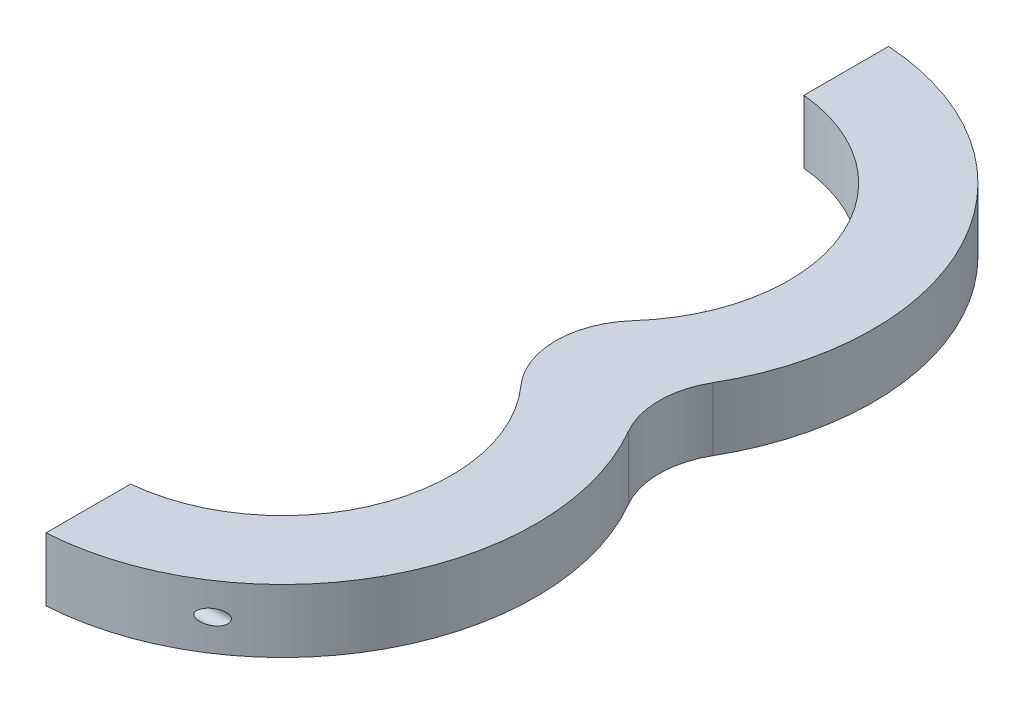
ISO-10303-21;
HEADER;
FILE_DESCRIPTION(('STEP AP214'),'2;1');
FILE_NAME('part.step','',(''),(''),'','','');
FILE_SCHEMA(('AUTOMOTIVE_DESIGN { 1 0 10303 214 1 1 1 1 }'));
ENDSEC;
DATA;
#1=APPLICATION_CONTEXT('core data for automotive mechanical design processes');
#2=APPLICATION_PROTOCOL_DEFINITION('international standard','automotive_design',2000,#1);
#3=PRODUCT_CONTEXT('',#1,'mechanical');
#4=PRODUCT('Part','Part','',(#3));
#5=PRODUCT_RELATED_PRODUCT_CATEGORY('part','',(#4));
#6=PRODUCT_DEFINITION_FORMATION('','',#4);
#7=PRODUCT_DEFINITION_CONTEXT('part definition',#1,'design');
#8=PRODUCT_DEFINITION('design','',#6,#7);
#9=PRODUCT_DEFINITION_SHAPE('','',#8);
#10=(LENGTH_UNIT() NAMED_UNIT(*) SI_UNIT(.MILLI.,.METRE.));
#11=(NAMED_UNIT(*) PLANE_ANGLE_UNIT() SI_UNIT($,.RADIAN.));
#12=(NAMED_UNIT(*) SI_UNIT($,.STERADIAN.) SOLID_ANGLE_UNIT());
#13=UNCERTAINTY_MEASURE_WITH_UNIT(LENGTH_MEASURE(1.E-05),#10,'distance_accuracy_value','');
#14=(GEOMETRIC_REPRESENTATION_CONTEXT(3) GLOBAL_UNCERTAINTY_ASSIGNED_CONTEXT((#13)) GLOBAL_UNIT_ASSIGNED_CONTEXT((#10,
#11,#12)) REPRESENTATION_CONTEXT('',''));
#15=CARTESIAN_POINT('',(0.,0.,0.));
#16=DIRECTION('',(0.,0.,1.));
#17=DIRECTION('',(1.,0.,0.));
#18=AXIS2_PLACEMENT_3D('',#15,#16,#17);
#19=CARTESIAN_POINT('',(219.2,-4.7625,25.4));
#20=DIRECTION('',(0.,-1.,0.));
#21=DIRECTION('',(0.,0.,-1.));
#22=AXIS2_PLACEMENT_3D('',#19,#20,#21);
#23=PLANE('',#22);
#24=DIRECTION('',(0.,0.,1.));
#25=VECTOR('',#24,1.);
#26=CARTESIAN_POINT('',(272.38125,-4.7625,-50.6881325612924));
#27=LINE('',#26,#25);
#28=CARTESIAN_POINT('',(272.38125,-4.7625,-63.4255131252361));
#29=VERTEX_POINT('',#28);
#30=CARTESIAN_POINT('',(272.38125,-4.7625,-50.6881325612924));
#31=VERTEX_POINT('',#30);
#32=EDGE_CURVE('E65',#29,#31,#27,.T.);
#33=ORIENTED_EDGE('',*,*,#32,.F.);
#34=CARTESIAN_POINT('',(270.,-4.7625,-25.4));
#35=DIRECTION('',(0.,1.,0.));
#36=DIRECTION('',(0.,0.,1.));
#37=AXIS2_PLACEMENT_3D('',#34,#35,#36);
#38=CIRCLE('',#37,38.1);
#39=CARTESIAN_POINT('',(302.995567884187,-4.7625,-6.34999999999999));
#40=VERTEX_POINT('',#39);
#41=EDGE_CURVE('E122',#40,#29,#38,.T.);
#42=ORIENTED_EDGE('',*,*,#41,.F.);
#43=CARTESIAN_POINT('',(313.994090512249,-4.7625,0.));
#44=DIRECTION('',(0.,-1.,0.));
#45=DIRECTION('',(0.,0.,1.));
#46=AXIS2_PLACEMENT_3D('',#43,#44,#45);
#47=CIRCLE('',#46,12.7);
#48=CARTESIAN_POINT('',(302.995567884187,-4.7625,6.34999999999999));
#49=VERTEX_POINT('',#48);
#50=EDGE_CURVE('E136',#49,#40,#47,.T.);
#51=ORIENTED_EDGE('',*,*,#50,.F.);
#52=CARTESIAN_POINT('',(270.,-4.7625,25.4));
#53=DIRECTION('',(0.,1.,0.));
#54=DIRECTION('',(0.,0.,1.));
#55=AXIS2_PLACEMENT_3D('',#52,#53,#54);
#56=CIRCLE('',#55,38.1);
#57=CARTESIAN_POINT('',(272.38125,-4.7625,63.4255131252361));
#58=VERTEX_POINT('',#57);
#59=EDGE_CURVE('E134',#58,#49,#56,.T.);
#60=ORIENTED_EDGE('',*,*,#59,.F.);
#61=DIRECTION('',(0.,0.,1.));
#62=VECTOR('',#61,1.);
#63=CARTESIAN_POINT('',(272.38125,-4.7625,50.6881325612925));
#64=LINE('',#63,#62);
#65=CARTESIAN_POINT('',(272.38125,-4.7625,50.6881325612925));
#66=VERTEX_POINT('',#65);
#67=EDGE_CURVE('E166',#66,#58,#64,.T.);
#68=ORIENTED_EDGE('',*,*,#67,.F.);
#69=CARTESIAN_POINT('',(270.,-4.7625,25.4));
#70=DIRECTION('',(0.,1.,0.));
#71=DIRECTION('',(0.,0.,1.));
#72=AXIS2_PLACEMENT_3D('',#69,#70,#71);
#73=CIRCLE('',#72,25.4);
#74=CARTESIAN_POINT('',(288.932042209498,-4.7625,8.46666666666666));
#75=VERTEX_POINT('',#74);
#76=EDGE_CURVE('E154',#66,#75,#73,.T.);
#77=ORIENTED_EDGE('',*,*,#76,.T.);
#78=CARTESIAN_POINT('',(298.398063314247,-4.7625,0.));
#79=DIRECTION('',(0.,-1.,0.));
#80=DIRECTION('',(0.,0.,1.));
#81=AXIS2_PLACEMENT_3D('',#78,#79,#80);
#82=CIRCLE('',#81,12.7);
#83=CARTESIAN_POINT('',(288.932042209498,-4.7625,-8.46666666666668));
#84=VERTEX_POINT('',#83);
#85=EDGE_CURVE('E151',#75,#84,#82,.T.);
#86=ORIENTED_EDGE('',*,*,#85,.T.);
#87=CARTESIAN_POINT('',(270.,-4.7625,-25.4));
#88=DIRECTION('',(0.,1.,0.));
#89=DIRECTION('',(0.,0.,1.));
#90=AXIS2_PLACEMENT_3D('',#87,#88,#89);
#91=CIRCLE('',#90,25.4);
#92=EDGE_CURVE('E147',#84,#31,#91,.T.);
#93=ORIENTED_EDGE('',*,*,#92,.T.);
#94=EDGE_LOOP('',(#33,#42,#51,#60,#68,#77,#86,#93));
#95=FACE_BOUND('',#94,.T.);
#96=ADVANCED_FACE('F36',(#95),#23,.T.);
#97=CARTESIAN_POINT('',(313.994090512249,4.7625,0.));
#98=DIRECTION('',(0.,-1.,0.));
#99=DIRECTION('',(0.,0.,-1.));
#100=AXIS2_PLACEMENT_3D('',#97,#98,#99);
#101=CYLINDRICAL_SURFACE('',#100,12.7);
#102=ORIENTED_EDGE('',*,*,#50,.T.);
#103=DIRECTION('',(0.,-1.,0.));
#104=VECTOR('',#103,1.);
#105=CARTESIAN_POINT('',(302.995567884187,4.7625,-6.34999999999999));
#106=LINE('',#105,#104);
#107=CARTESIAN_POINT('',(302.995567884187,4.7625,-6.34999999999999));
#108=VERTEX_POINT('',#107);
#109=EDGE_CURVE('E50',#108,#40,#106,.T.);
#110=ORIENTED_EDGE('',*,*,#109,.F.);
#111=CARTESIAN_POINT('',(313.994090512249,4.7625,0.));
#112=DIRECTION('',(0.,-1.,0.));
#113=DIRECTION('',(0.,0.,1.));
#114=AXIS2_PLACEMENT_3D('',#111,#112,#113);
#115=CIRCLE('',#114,12.7);
#116=CARTESIAN_POINT('',(302.995567884187,4.7625,6.34999999999999));
#117=VERTEX_POINT('',#116);
#118=EDGE_CURVE('E126',#117,#108,#115,.T.);
#119=ORIENTED_EDGE('',*,*,#118,.F.);
#120=DIRECTION('',(0.,-1.,0.));
#121=VECTOR('',#120,1.);
#122=CARTESIAN_POINT('',(302.995567884187,4.7625,6.34999999999999));
#123=LINE('',#122,#121);
#124=EDGE_CURVE('E11',#117,#49,#123,.T.);
#125=ORIENTED_EDGE('',*,*,#124,.T.);
#126=EDGE_LOOP('',(#102,#110,#119,#125));
#127=FACE_BOUND('',#126,.T.);
#128=ADVANCED_FACE('F205',(#127),#101,.F.);
#129=CARTESIAN_POINT('',(298.398063314247,4.7625,0.));
#130=DIRECTION('',(0.,-1.,0.));
#131=DIRECTION('',(0.,0.,-1.));
#132=AXIS2_PLACEMENT_3D('',#129,#130,#131);
#133=CYLINDRICAL_SURFACE('',#132,12.7);
#134=ORIENTED_EDGE('',*,*,#85,.F.);
#135=DIRECTION('',(0.,-1.,0.));
#136=VECTOR('',#135,1.);
#137=CARTESIAN_POINT('',(288.932042209498,4.7625,8.46666666666666));
#138=LINE('',#137,#136);
#139=CARTESIAN_POINT('',(288.932042209498,4.7625,8.46666666666666));
#140=VERTEX_POINT('',#139);
#141=EDGE_CURVE('E137',#140,#75,#138,.T.);
#142=ORIENTED_EDGE('',*,*,#141,.F.);
#143=CARTESIAN_POINT('',(298.398063314247,4.7625,0.));
#144=DIRECTION('',(0.,-1.,0.));
#145=DIRECTION('',(0.,0.,1.));
#146=AXIS2_PLACEMENT_3D('',#143,#144,#145);
#147=CIRCLE('',#146,12.7);
#148=CARTESIAN_POINT('',(288.932042209498,4.7625,-8.46666666666669));
#149=VERTEX_POINT('',#148);
#150=EDGE_CURVE('E157',#140,#149,#147,.T.);
#151=ORIENTED_EDGE('',*,*,#150,.T.);
#152=DIRECTION('',(0.,-1.,0.));
#153=VECTOR('',#152,1.);
#154=CARTESIAN_POINT('',(288.932042209498,4.7625,-8.46666666666668));
#155=LINE('',#154,#153);
#156=EDGE_CURVE('E144',#149,#84,#155,.T.);
#157=ORIENTED_EDGE('',*,*,#156,.T.);
#158=EDGE_LOOP('',(#134,#142,#151,#157));
#159=FACE_BOUND('',#158,.T.);
#160=ADVANCED_FACE('F202',(#159),#133,.T.);
#161=CARTESIAN_POINT('',(270.,4.7625,-25.4));
#162=DIRECTION('',(0.,-1.,0.));
#163=DIRECTION('',(0.,0.,-1.));
#164=AXIS2_PLACEMENT_3D('',#161,#162,#163);
#165=CYLINDRICAL_SURFACE('',#164,38.1);
#166=CARTESIAN_POINT('',(289.406560119215,0.,-58.1871228432642));
#167=CARTESIAN_POINT('',(289.406562233935,0.0346801125895639,-58.1871216207946));
#168=CARTESIAN_POINT('',(289.409284095073,0.0693698752678581,-58.1855109939541));
#169=CARTESIAN_POINT('',(289.419883175325,0.137668433217253,-58.1792338705122));
#170=CARTESIAN_POINT('',(289.427765688506,0.171276081212509,-58.1745642358164));
#171=CARTESIAN_POINT('',(289.450302147413,0.244149867071134,-58.1611958309623));
#172=CARTESIAN_POINT('',(289.466098696342,0.28293285932613,-58.1518160923462));
#173=CARTESIAN_POINT('',(289.502830730684,0.357018850528717,-58.1299564807417));
#174=CARTESIAN_POINT('',(289.523775999186,0.39231504309651,-58.1174707054219));
#175=CARTESIAN_POINT('',(289.581934432732,0.477790477666184,-58.0827098089543));
#176=CARTESIAN_POINT('',(289.621767567246,0.525508661634553,-58.0588225025396));
#177=CARTESIAN_POINT('',(289.706931435582,0.613503294476221,-58.0075044573772));
#178=CARTESIAN_POINT('',(289.752275625829,0.653760896745626,-57.9800650343));
#179=CARTESIAN_POINT('',(289.841757949813,0.724232832760032,-57.9256377411945));
#180=CARTESIAN_POINT('',(289.885568603557,0.755047536320301,-57.8988756785087));
#181=CARTESIAN_POINT('',(289.975165918582,0.812212736925812,-57.8438825271822));
#182=CARTESIAN_POINT('',(290.020954093864,0.83855973463429,-57.8156503094552));
#183=CARTESIAN_POINT('',(290.113979254642,0.887322189742761,-57.7580104263982));
#184=CARTESIAN_POINT('',(290.161218630081,0.909730702648264,-57.7286007948817));
#185=CARTESIAN_POINT('',(290.25668801677,0.950944877747121,-57.6688668202606));
#186=CARTESIAN_POINT('',(290.304918335998,0.969749400509859,-57.6385421913678));
#187=CARTESIAN_POINT('',(290.432583828691,1.01479895716542,-57.5578646075085));
#188=CARTESIAN_POINT('',(290.512600709846,1.0383039134802,-57.5068895230887));
#189=CARTESIAN_POINT('',(290.673646396888,1.07726300966779,-57.4034298434705));
#190=CARTESIAN_POINT('',(290.754675819533,1.09271197050571,-57.3509443000471));
#191=CARTESIAN_POINT('',(290.917161041848,1.11588160140344,-57.2448080084178));
#192=CARTESIAN_POINT('',(290.998617119342,1.12359637420809,-57.1911564028955));
#193=CARTESIAN_POINT('',(291.161337946686,1.13129259033628,-57.0830760763894));
#194=CARTESIAN_POINT('',(291.242602763092,1.13127731614336,-57.0286476950737));
#195=CARTESIAN_POINT('',(291.388055455731,1.12405871127778,-56.9304163246908));
#196=CARTESIAN_POINT('',(291.452370935984,1.11831072964363,-56.8866922353655));
#197=CARTESIAN_POINT('',(291.580248746316,1.10144761486723,-56.7991856966475));
#198=CARTESIAN_POINT('',(291.643811230021,1.09033359652731,-56.7554032612594));
#199=CARTESIAN_POINT('',(291.769649624393,1.06236396339444,-56.6681659175263));
#200=CARTESIAN_POINT('',(291.831928488309,1.04552358206269,-56.624710449686));
#201=CARTESIAN_POINT('',(291.95483067079,1.00553183203822,-56.5384174573502));
#202=CARTESIAN_POINT('',(292.015455042425,0.982384585789599,-56.4955795483824));
#203=CARTESIAN_POINT('',(292.138884830195,0.926979653277689,-56.4078366226465));
#204=CARTESIAN_POINT('',(292.201507844251,0.894164871834992,-56.363020671042));
#205=CARTESIAN_POINT('',(292.322698553718,0.819046005067672,-56.2757620196224));
#206=CARTESIAN_POINT('',(292.381268255155,0.776746658344159,-56.2333181478712));
#207=CARTESIAN_POINT('',(292.479377728113,0.69202666469989,-56.1618332728355));
#208=CARTESIAN_POINT('',(292.520209367346,0.6518382902294,-56.1319445763034));
#209=CARTESIAN_POINT('',(292.596339594416,0.564162389637554,-56.0760110144988));
#210=CARTESIAN_POINT('',(292.631649150578,0.516689713649981,-56.0499585356567));
#211=CARTESIAN_POINT('',(292.684995516328,0.429326993468788,-56.010484166137));
#212=CARTESIAN_POINT('',(292.705053301311,0.391340935065918,-55.9956047547817));
#213=CARTESIAN_POINT('',(292.740061532444,0.31185755350866,-55.96959399213));
#214=CARTESIAN_POINT('',(292.755015811396,0.270362894714637,-55.9584598281929));
#215=CARTESIAN_POINT('',(292.778768700667,0.184195687573772,-55.940758400379));
#216=CARTESIAN_POINT('',(292.787503851091,0.139495361649586,-55.934238221502));
#217=CARTESIAN_POINT('',(292.797648382188,0.0488222805704054,-55.9266649498136));
#218=CARTESIAN_POINT('',(292.799064888994,0.00285080700369756,-55.9256065389034));
#219=CARTESIAN_POINT('',(292.7947719878,-0.0818883479753645,-55.9288121444724));
#220=CARTESIAN_POINT('',(292.790058301424,-0.120741041965621,-55.9323324534614));
#221=CARTESIAN_POINT('',(292.775563865996,-0.196938195470066,-55.9431460669602));
#222=CARTESIAN_POINT('',(292.76578093001,-0.234281996528674,-55.950440999885));
#223=CARTESIAN_POINT('',(292.738643262385,-0.316263147761094,-55.9706469545663));
#224=CARTESIAN_POINT('',(292.719970890241,-0.360220603107252,-55.9845325758885));
#225=CARTESIAN_POINT('',(292.677122491262,-0.443770910076259,-56.0163163767324));
#226=CARTESIAN_POINT('',(292.652936787548,-0.483355903699907,-56.0342216105398));
#227=CARTESIAN_POINT('',(292.588425674969,-0.575104789021504,-56.08183935514));
#228=CARTESIAN_POINT('',(292.545774031392,-0.624756084429294,-56.1132094852051));
#229=CARTESIAN_POINT('',(292.454692328507,-0.715328808539313,-56.179863518933));
#230=CARTESIAN_POINT('',(292.406249534233,-0.756230424680561,-56.2151560356407));
#231=CARTESIAN_POINT('',(292.31476247538,-0.823512784541487,-56.2814501260151));
#232=CARTESIAN_POINT('',(292.272356745203,-0.851180937563113,-56.3120521177981));
#233=CARTESIAN_POINT('',(292.185624476951,-0.901906171715305,-56.3743591989242));
#234=CARTESIAN_POINT('',(292.141296765804,-0.92496038714368,-56.4060649595535));
#235=CARTESIAN_POINT('',(292.006105546879,-0.987921669335295,-56.502307062415));
#236=CARTESIAN_POINT('',(291.913082185523,-1.02159388106021,-56.567933207491));
#237=CARTESIAN_POINT('',(291.744222522421,-1.06916230874567,-56.6858923345634));
#238=CARTESIAN_POINT('',(291.668975194095,-1.08575016733129,-56.7380601223131));
#239=CARTESIAN_POINT('',(291.517164249508,-1.11109313957978,-56.8424890943284));
#240=CARTESIAN_POINT('',(291.44059989255,-1.11984368829351,-56.8947503152831));
#241=CARTESIAN_POINT('',(291.286498530095,-1.13004659119717,-56.9991088197158));
#242=CARTESIAN_POINT('',(291.208959032781,-1.13147286092573,-57.051204857822));
#243=CARTESIAN_POINT('',(291.053657074615,-1.12724291461275,-57.1547197845982));
#244=CARTESIAN_POINT('',(290.975894684556,-1.12158874210598,-57.2061388643223));
#245=CARTESIAN_POINT('',(290.817869152717,-1.10292761958626,-57.309803526319));
#246=CARTESIAN_POINT('',(290.737613212397,-1.08967151073022,-57.3620155490388));
#247=CARTESIAN_POINT('',(290.577823428524,-1.05537809196454,-57.4651247523037));
#248=CARTESIAN_POINT('',(290.498290111918,-1.03433550806967,-57.516021016595));
#249=CARTESIAN_POINT('',(290.3412582736,-0.984035098688015,-57.6157074539435));
#250=CARTESIAN_POINT('',(290.263749943172,-0.954831078696793,-57.6645090839277));
#251=CARTESIAN_POINT('',(290.111424710099,-0.887124227906148,-57.7596757994706));
#252=CARTESIAN_POINT('',(290.03660337167,-0.848637616416994,-57.8060449650386));
#253=CARTESIAN_POINT('',(289.921400282478,-0.778699051811462,-57.8769200626549));
#254=CARTESIAN_POINT('',(289.87951975397,-0.750872490458157,-57.9025688499635));
#255=CARTESIAN_POINT('',(289.797957233063,-0.690794778404592,-57.952314286829));
#256=CARTESIAN_POINT('',(289.758277007472,-0.658540142244464,-57.9764096914989));
#257=CARTESIAN_POINT('',(289.681878318495,-0.588704875120458,-58.0226251784179));
#258=CARTESIAN_POINT('',(289.645185088736,-0.551085044472116,-58.0447285725392));
#259=CARTESIAN_POINT('',(289.576799076671,-0.469972112411677,-58.0857846518375));
#260=CARTESIAN_POINT('',(289.545097273371,-0.426489876493713,-58.1047430244097));
#261=CARTESIAN_POINT('',(289.498682359433,-0.348899682197522,-58.1324282438669));
#262=CARTESIAN_POINT('',(289.481838045911,-0.31654167496011,-58.1424537267425));
#263=CARTESIAN_POINT('',(289.452568701086,-0.249216596669655,-58.1598513568702));
#264=CARTESIAN_POINT('',(289.44013626072,-0.214254020239572,-58.1672279527718));
#265=CARTESIAN_POINT('',(289.422682617623,-0.149473715357125,-58.177575909201));
#266=CARTESIAN_POINT('',(289.41667921632,-0.120015645840364,-58.1811316116476));
#267=CARTESIAN_POINT('',(289.408617602413,-0.0603740174385645,-58.185905281459));
#268=CARTESIAN_POINT('',(289.406558278252,-0.0301906653885602,-58.1871239074815));
#269=CARTESIAN_POINT('',(289.406560119215,0.,-58.1871228432642));
#270=B_SPLINE_CURVE_WITH_KNOTS('',3,(#166,#167,#168,#169,#170,#171,#172,#173,#174,#175,#176,
#177,#178,#179,#180,#181,#182,#183,#184,#185,#186,#187,#188,#189,#190,#191,#192,#193,#194,#195,
#196,#197,#198,#199,#200,#201,#202,#203,#204,#205,#206,#207,#208,#209,#210,#211,#212,#213,#214,
#215,#216,#217,#218,#219,#220,#221,#222,#223,#224,#225,#226,#227,#228,#229,#230,#231,#232,#233,
#234,#235,#236,#237,#238,#239,#240,#241,#242,#243,#244,#245,#246,#247,#248,#249,#250,#251,#252,
#253,#254,#255,#256,#257,#258,#259,#260,#261,#262,#263,#264,#265,#266,#267,#268,#269),
.UNSPECIFIED.,.T.,.F.,(4,2,2,2,2,2,2,2,2,2,2,2,2,2,2,2,2,2,2,2,2,2,2,2,2,2,2,2,2,2,2,2,2,2,2,2,
2,2,2,2,2,2,2,2,2,2,2,2,2,2,2,4),(0.,0.103920496165342,0.207947766843529,0.335972824378085,
0.464243048721362,0.6628989252404,0.862049993625712,1.04142215738254,1.22093417211763,
1.40075960170757,1.58064179111219,1.87345124355099,2.16644870585037,2.45966940678813,
2.75276559472907,2.98654478985379,3.22027543787756,3.45338911007562,3.68635077296566,
3.93695095565995,4.187426213411,4.38071925837762,4.57362335752059,4.70953063169235,
4.84533561188242,4.98250722011539,5.11954523974022,5.23687094599213,5.35424731012057,
5.50263632081444,5.65128781382482,5.86783439079446,6.08486623840808,6.26210805900783,
6.43945962462442,6.79436559999853,7.07321350585504,7.3522237250894,7.63222691699457,
7.91214931388929,8.2018182237878,8.4916836943003,8.77968152165739,9.06717973519756,
9.23633592991024,9.40562604380066,9.57622326423973,9.7465085351751,9.85965750936607,
9.97261555784624,10.0631087336916,10.1535764021179),.UNSPECIFIED.);
#271=CARTESIAN_POINT('',(289.406560119215,0.,-58.1871228432642));
#272=VERTEX_POINT('',#271);
#273=EDGE_CURVE('E174',#272,#272,#270,.T.);
#274=ORIENTED_EDGE('',*,*,#273,.F.);
#275=EDGE_LOOP('',(#274));
#276=FACE_BOUND('',#275,.T.);
#277=ORIENTED_EDGE('',*,*,#41,.T.);
#278=DIRECTION('',(0.,-1.,0.));
#279=VECTOR('',#278,1.);
#280=CARTESIAN_POINT('',(272.38125,4.7625,-63.4255131252361));
#281=LINE('',#280,#279);
#282=CARTESIAN_POINT('',(272.38125,4.7625,-63.4255131252361));
#283=VERTEX_POINT('',#282);
#284=EDGE_CURVE('E108',#283,#29,#281,.T.);
#285=ORIENTED_EDGE('',*,*,#284,.F.);
#286=CARTESIAN_POINT('',(270.,4.7625,-25.4));
#287=DIRECTION('',(0.,1.,0.));
#288=DIRECTION('',(0.,0.,1.));
#289=AXIS2_PLACEMENT_3D('',#286,#287,#288);
#290=CIRCLE('',#289,38.1);
#291=EDGE_CURVE('E120',#108,#283,#290,.T.);
#292=ORIENTED_EDGE('',*,*,#291,.F.);
#293=ORIENTED_EDGE('',*,*,#109,.T.);
#294=EDGE_LOOP('',(#277,#285,#292,#293));
#295=FACE_BOUND('',#294,.T.);
#296=ADVANCED_FACE('F118',(#276,#295),#165,.T.);
#297=CARTESIAN_POINT('',(270.,4.7625,25.4));
#298=DIRECTION('',(0.,-1.,0.));
#299=DIRECTION('',(0.,0.,-1.));
#300=AXIS2_PLACEMENT_3D('',#297,#298,#299);
#301=CYLINDRICAL_SURFACE('',#300,25.4);
#302=DIRECTION('',(0.,-1.,0.));
#303=VECTOR('',#302,1.);
#304=CARTESIAN_POINT('',(272.38125,4.7625,50.6881325612925));
#305=LINE('',#304,#303);
#306=CARTESIAN_POINT('',(272.38125,4.7625,50.6881325612925));
#307=VERTEX_POINT('',#306);
#308=EDGE_CURVE('E161',#307,#66,#305,.T.);
#309=ORIENTED_EDGE('',*,*,#308,.F.);
#310=CARTESIAN_POINT('',(270.,4.7625,25.4));
#311=DIRECTION('',(0.,1.,0.));
#312=DIRECTION('',(0.,0.,1.));
#313=AXIS2_PLACEMENT_3D('',#310,#311,#312);
#314=CIRCLE('',#313,25.4);
#315=EDGE_CURVE('E150',#307,#140,#314,.T.);
#316=ORIENTED_EDGE('',*,*,#315,.T.);
#317=ORIENTED_EDGE('',*,*,#141,.T.);
#318=ORIENTED_EDGE('',*,*,#76,.F.);
#319=EDGE_LOOP('',(#309,#316,#317,#318));
#320=FACE_BOUND('',#319,.T.);
#321=ADVANCED_FACE('F207',(#320),#301,.F.);
#322=CARTESIAN_POINT('',(219.2,4.7625,25.4));
#323=DIRECTION('',(0.,-1.,0.));
#324=DIRECTION('',(0.,0.,-1.));
#325=AXIS2_PLACEMENT_3D('',#322,#323,#324);
#326=PLANE('',#325);
#327=ORIENTED_EDGE('',*,*,#291,.T.);
#328=DIRECTION('',(0.,0.,1.));
#329=VECTOR('',#328,1.);
#330=CARTESIAN_POINT('',(272.38125,4.7625,-50.6881325612924));
#331=LINE('',#330,#329);
#332=CARTESIAN_POINT('',(272.38125,4.7625,-50.6881325612924));
#333=VERTEX_POINT('',#332);
#334=EDGE_CURVE('E105',#283,#333,#331,.T.);
#335=ORIENTED_EDGE('',*,*,#334,.T.);
#336=CARTESIAN_POINT('',(270.,4.7625,-25.4));
#337=DIRECTION('',(0.,1.,0.));
#338=DIRECTION('',(0.,0.,1.));
#339=AXIS2_PLACEMENT_3D('',#336,#337,#338);
#340=CIRCLE('',#339,25.4);
#341=EDGE_CURVE('E146',#149,#333,#340,.T.);
#342=ORIENTED_EDGE('',*,*,#341,.F.);
#343=ORIENTED_EDGE('',*,*,#150,.F.);
#344=ORIENTED_EDGE('',*,*,#315,.F.);
#345=DIRECTION('',(0.,0.,1.));
#346=VECTOR('',#345,1.);
#347=CARTESIAN_POINT('',(272.38125,4.7625,50.6881325612925));
#348=LINE('',#347,#346);
#349=CARTESIAN_POINT('',(272.38125,4.7625,63.4255131252361));
#350=VERTEX_POINT('',#349);
#351=EDGE_CURVE('E57',#307,#350,#348,.T.);
#352=ORIENTED_EDGE('',*,*,#351,.T.);
#353=CARTESIAN_POINT('',(270.,4.7625,25.4));
#354=DIRECTION('',(0.,1.,0.));
#355=DIRECTION('',(0.,0.,1.));
#356=AXIS2_PLACEMENT_3D('',#353,#354,#355);
#357=CIRCLE('',#356,38.1);
#358=EDGE_CURVE('E130',#350,#117,#357,.T.);
#359=ORIENTED_EDGE('',*,*,#358,.T.);
#360=ORIENTED_EDGE('',*,*,#118,.T.);
#361=EDGE_LOOP('',(#327,#335,#342,#343,#344,#352,#359,#360));
#362=FACE_BOUND('',#361,.T.);
#363=ADVANCED_FACE('F124',(#362),#326,.F.);
#364=CARTESIAN_POINT('',(270.,4.7625,25.4));
#365=DIRECTION('',(0.,-1.,0.));
#366=DIRECTION('',(0.,0.,-1.));
#367=AXIS2_PLACEMENT_3D('',#364,#365,#366);
#368=CYLINDRICAL_SURFACE('',#367,38.1);
#369=CARTESIAN_POINT('',(289.406560119215,0.,58.1871228432642));
#370=CARTESIAN_POINT('',(289.406562233935,0.0346801125895639,58.1871216207946));
#371=CARTESIAN_POINT('',(289.409284095073,0.0693698752678581,58.1855109939541));
#372=CARTESIAN_POINT('',(289.419883175325,0.137668433217253,58.1792338705122));
#373=CARTESIAN_POINT('',(289.427765688506,0.171276081212509,58.1745642358164));
#374=CARTESIAN_POINT('',(289.450302147413,0.244149867071134,58.1611958309623));
#375=CARTESIAN_POINT('',(289.466098696342,0.28293285932613,58.1518160923462));
#376=CARTESIAN_POINT('',(289.502830730684,0.357018850528717,58.1299564807417));
#377=CARTESIAN_POINT('',(289.523775999186,0.39231504309651,58.1174707054219));
#378=CARTESIAN_POINT('',(289.581934432732,0.477790477666184,58.0827098089543));
#379=CARTESIAN_POINT('',(289.621767567246,0.525508661634553,58.0588225025396));
#380=CARTESIAN_POINT('',(289.706931435582,0.613503294476221,58.0075044573772));
#381=CARTESIAN_POINT('',(289.752275625829,0.653760896745626,57.9800650343));
#382=CARTESIAN_POINT('',(289.841757949813,0.724232832760032,57.9256377411945));
#383=CARTESIAN_POINT('',(289.885568603557,0.755047536320301,57.8988756785087));
#384=CARTESIAN_POINT('',(289.975165918582,0.812212736925812,57.8438825271822));
#385=CARTESIAN_POINT('',(290.020954093864,0.83855973463429,57.8156503094552));
#386=CARTESIAN_POINT('',(290.113979254642,0.887322189742761,57.7580104263982));
#387=CARTESIAN_POINT('',(290.161218630081,0.909730702648264,57.7286007948817));
#388=CARTESIAN_POINT('',(290.25668801677,0.950944877747121,57.6688668202606));
#389=CARTESIAN_POINT('',(290.304918335998,0.969749400509859,57.6385421913678));
#390=CARTESIAN_POINT('',(290.432583828691,1.01479895716542,57.5578646075085));
#391=CARTESIAN_POINT('',(290.512600709846,1.0383039134802,57.5068895230887));
#392=CARTESIAN_POINT('',(290.673646396888,1.07726300966779,57.4034298434705));
#393=CARTESIAN_POINT('',(290.754675819533,1.09271197050571,57.3509443000471));
#394=CARTESIAN_POINT('',(290.917161041848,1.11588160140344,57.2448080084178));
#395=CARTESIAN_POINT('',(290.998617119342,1.12359637420809,57.1911564028955));
#396=CARTESIAN_POINT('',(291.161337946686,1.13129259033628,57.0830760763894));
#397=CARTESIAN_POINT('',(291.242602763092,1.13127731614336,57.0286476950737));
#398=CARTESIAN_POINT('',(291.388055455731,1.12405871127778,56.9304163246908));
#399=CARTESIAN_POINT('',(291.452370935984,1.11831072964363,56.8866922353655));
#400=CARTESIAN_POINT('',(291.580248746316,1.10144761486723,56.7991856966475));
#401=CARTESIAN_POINT('',(291.643811230021,1.09033359652731,56.7554032612594));
#402=CARTESIAN_POINT('',(291.769649624393,1.06236396339444,56.6681659175263));
#403=CARTESIAN_POINT('',(291.831928488309,1.04552358206269,56.624710449686));
#404=CARTESIAN_POINT('',(291.95483067079,1.00553183203822,56.5384174573502));
#405=CARTESIAN_POINT('',(292.015455042425,0.982384585789599,56.4955795483824));
#406=CARTESIAN_POINT('',(292.138884830195,0.926979653277689,56.4078366226465));
#407=CARTESIAN_POINT('',(292.201507844251,0.894164871834992,56.363020671042));
#408=CARTESIAN_POINT('',(292.322698553718,0.819046005067672,56.2757620196224));
#409=CARTESIAN_POINT('',(292.381268255155,0.776746658344159,56.2333181478712));
#410=CARTESIAN_POINT('',(292.479377728113,0.69202666469989,56.1618332728355));
#411=CARTESIAN_POINT('',(292.520209367346,0.6518382902294,56.1319445763034));
#412=CARTESIAN_POINT('',(292.596339594416,0.564162389637554,56.0760110144988));
#413=CARTESIAN_POINT('',(292.631649150578,0.516689713649981,56.0499585356567));
#414=CARTESIAN_POINT('',(292.684995516328,0.429326993468788,56.010484166137));
#415=CARTESIAN_POINT('',(292.705053301311,0.391340935065918,55.9956047547817));
#416=CARTESIAN_POINT('',(292.740061532444,0.31185755350866,55.96959399213));
#417=CARTESIAN_POINT('',(292.755015811396,0.270362894714637,55.9584598281929));
#418=CARTESIAN_POINT('',(292.778768700667,0.184195687573772,55.940758400379));
#419=CARTESIAN_POINT('',(292.787503851091,0.139495361649586,55.934238221502));
#420=CARTESIAN_POINT('',(292.797648382188,0.0488222805704054,55.9266649498136));
#421=CARTESIAN_POINT('',(292.799064888994,0.00285080700369756,55.9256065389034));
#422=CARTESIAN_POINT('',(292.7947719878,-0.0818883479753645,55.9288121444724));
#423=CARTESIAN_POINT('',(292.790058301424,-0.120741041965621,55.9323324534614));
#424=CARTESIAN_POINT('',(292.775563865996,-0.196938195470066,55.9431460669602));
#425=CARTESIAN_POINT('',(292.76578093001,-0.234281996528674,55.950440999885));
#426=CARTESIAN_POINT('',(292.738643262385,-0.316263147761094,55.9706469545663));
#427=CARTESIAN_POINT('',(292.719970890241,-0.360220603107252,55.9845325758885));
#428=CARTESIAN_POINT('',(292.677122491262,-0.443770910076259,56.0163163767324));
#429=CARTESIAN_POINT('',(292.652936787548,-0.483355903699907,56.0342216105398));
#430=CARTESIAN_POINT('',(292.588425674969,-0.575104789021504,56.08183935514));
#431=CARTESIAN_POINT('',(292.545774031392,-0.624756084429294,56.1132094852051));
#432=CARTESIAN_POINT('',(292.454692328507,-0.715328808539313,56.179863518933));
#433=CARTESIAN_POINT('',(292.406249534233,-0.756230424680561,56.2151560356407));
#434=CARTESIAN_POINT('',(292.31476247538,-0.823512784541487,56.2814501260151));
#435=CARTESIAN_POINT('',(292.272356745203,-0.851180937563113,56.3120521177981));
#436=CARTESIAN_POINT('',(292.185624476951,-0.901906171715305,56.3743591989242));
#437=CARTESIAN_POINT('',(292.141296765804,-0.92496038714368,56.4060649595535));
#438=CARTESIAN_POINT('',(292.006105546879,-0.987921669335295,56.502307062415));
#439=CARTESIAN_POINT('',(291.913082185523,-1.02159388106021,56.567933207491));
#440=CARTESIAN_POINT('',(291.744222522421,-1.06916230874567,56.6858923345634));
#441=CARTESIAN_POINT('',(291.668975194095,-1.08575016733129,56.7380601223131));
#442=CARTESIAN_POINT('',(291.517164249508,-1.11109313957978,56.8424890943284));
#443=CARTESIAN_POINT('',(291.44059989255,-1.11984368829351,56.8947503152831));
#444=CARTESIAN_POINT('',(291.286498530095,-1.13004659119717,56.9991088197158));
#445=CARTESIAN_POINT('',(291.208959032781,-1.13147286092573,57.051204857822));
#446=CARTESIAN_POINT('',(291.053657074615,-1.12724291461275,57.1547197845982));
#447=CARTESIAN_POINT('',(290.975894684556,-1.12158874210598,57.2061388643223));
#448=CARTESIAN_POINT('',(290.817869152717,-1.10292761958626,57.309803526319));
#449=CARTESIAN_POINT('',(290.737613212397,-1.08967151073022,57.3620155490388));
#450=CARTESIAN_POINT('',(290.577823428524,-1.05537809196454,57.4651247523037));
#451=CARTESIAN_POINT('',(290.498290111918,-1.03433550806967,57.516021016595));
#452=CARTESIAN_POINT('',(290.3412582736,-0.984035098688015,57.6157074539435));
#453=CARTESIAN_POINT('',(290.263749943172,-0.954831078696793,57.6645090839277));
#454=CARTESIAN_POINT('',(290.111424710099,-0.887124227906148,57.7596757994706));
#455=CARTESIAN_POINT('',(290.03660337167,-0.848637616416994,57.8060449650386));
#456=CARTESIAN_POINT('',(289.921400282478,-0.778699051811462,57.8769200626549));
#457=CARTESIAN_POINT('',(289.87951975397,-0.750872490458157,57.9025688499635));
#458=CARTESIAN_POINT('',(289.797957233063,-0.690794778404592,57.952314286829));
#459=CARTESIAN_POINT('',(289.758277007472,-0.658540142244464,57.9764096914989));
#460=CARTESIAN_POINT('',(289.681878318495,-0.588704875120458,58.0226251784179));
#461=CARTESIAN_POINT('',(289.645185088736,-0.551085044472116,58.0447285725392));
#462=CARTESIAN_POINT('',(289.576799076671,-0.469972112411677,58.0857846518375));
#463=CARTESIAN_POINT('',(289.545097273371,-0.426489876493713,58.1047430244097));
#464=CARTESIAN_POINT('',(289.498682359433,-0.348899682197522,58.1324282438669));
#465=CARTESIAN_POINT('',(289.481838045911,-0.31654167496011,58.1424537267425));
#466=CARTESIAN_POINT('',(289.452568701086,-0.249216596669655,58.1598513568702));
#467=CARTESIAN_POINT('',(289.44013626072,-0.214254020239572,58.1672279527718));
#468=CARTESIAN_POINT('',(289.422682617623,-0.149473715357125,58.177575909201));
#469=CARTESIAN_POINT('',(289.41667921632,-0.120015645840364,58.1811316116476));
#470=CARTESIAN_POINT('',(289.408617602413,-0.0603740174385645,58.185905281459));
#471=CARTESIAN_POINT('',(289.406558278252,-0.0301906653885602,58.1871239074815));
#472=CARTESIAN_POINT('',(289.406560119215,0.,58.1871228432642));
#473=B_SPLINE_CURVE_WITH_KNOTS('',3,(#369,#370,#371,#372,#373,#374,#375,#376,#377,#378,#379,
#380,#381,#382,#383,#384,#385,#386,#387,#388,#389,#390,#391,#392,#393,#394,#395,#396,#397,#398,
#399,#400,#401,#402,#403,#404,#405,#406,#407,#408,#409,#410,#411,#412,#413,#414,#415,#416,#417,
#418,#419,#420,#421,#422,#423,#424,#425,#426,#427,#428,#429,#430,#431,#432,#433,#434,#435,#436,
#437,#438,#439,#440,#441,#442,#443,#444,#445,#446,#447,#448,#449,#450,#451,#452,#453,#454,#455,
#456,#457,#458,#459,#460,#461,#462,#463,#464,#465,#466,#467,#468,#469,#470,#471,#472),
.UNSPECIFIED.,.T.,.F.,(4,2,2,2,2,2,2,2,2,2,2,2,2,2,2,2,2,2,2,2,2,2,2,2,2,2,2,2,2,2,2,2,2,2,2,2,
2,2,2,2,2,2,2,2,2,2,2,2,2,2,2,4),(0.,0.103920496165342,0.207947766843529,0.335972824378085,
0.464243048721362,0.6628989252404,0.862049993625712,1.04142215738254,1.22093417211763,
1.40075960170757,1.58064179111219,1.87345124355099,2.16644870585037,2.45966940678813,
2.75276559472907,2.98654478985379,3.22027543787756,3.45338911007562,3.68635077296566,
3.93695095565995,4.187426213411,4.38071925837762,4.57362335752059,4.70953063169235,
4.84533561188242,4.98250722011539,5.11954523974022,5.23687094599213,5.35424731012057,
5.50263632081444,5.65128781382482,5.86783439079446,6.08486623840808,6.26210805900783,
6.43945962462442,6.79436559999853,7.07321350585504,7.3522237250894,7.63222691699457,
7.91214931388929,8.2018182237878,8.4916836943003,8.77968152165739,9.06717973519756,
9.23633592991024,9.40562604380066,9.57622326423973,9.7465085351751,9.85965750936607,
9.97261555784624,10.0631087336916,10.1535764021179),.UNSPECIFIED.);
#474=CARTESIAN_POINT('',(289.406560119215,0.,58.1871228432642));
#475=VERTEX_POINT('',#474);
#476=EDGE_CURVE('E41',#475,#475,#473,.T.);
#477=ORIENTED_EDGE('',*,*,#476,.T.);
#478=EDGE_LOOP('',(#477));
#479=FACE_BOUND('',#478,.T.);
#480=ORIENTED_EDGE('',*,*,#358,.F.);
#481=DIRECTION('',(0.,-1.,0.));
#482=VECTOR('',#481,1.);
#483=CARTESIAN_POINT('',(272.38125,4.7625,63.4255131252361));
#484=LINE('',#483,#482);
#485=EDGE_CURVE('E163',#350,#58,#484,.T.);
#486=ORIENTED_EDGE('',*,*,#485,.T.);
#487=ORIENTED_EDGE('',*,*,#59,.T.);
#488=ORIENTED_EDGE('',*,*,#124,.F.);
#489=EDGE_LOOP('',(#480,#486,#487,#488));
#490=FACE_BOUND('',#489,.T.);
#491=ADVANCED_FACE('F38',(#479,#490),#368,.T.);
#492=CARTESIAN_POINT('',(272.38125,0.,57.0568228432643));
#493=DIRECTION('',(-1.,0.,0.));
#494=DIRECTION('',(0.,0.,1.));
#495=AXIS2_PLACEMENT_3D('',#492,#493,#494);
#496=CYLINDRICAL_SURFACE('',#495,1.13029999999999);
#497=CARTESIAN_POINT('',(272.38125,0.,57.0568228432643));
#498=DIRECTION('',(-1.,0.,0.));
#499=DIRECTION('',(0.,0.,1.));
#500=AXIS2_PLACEMENT_3D('',#497,#498,#499);
#501=CIRCLE('',#500,1.13029999999999);
#502=CARTESIAN_POINT('',(272.38125,0.,58.1871228432642));
#503=VERTEX_POINT('',#502);
#504=EDGE_CURVE('E171',#503,#503,#501,.T.);
#505=ORIENTED_EDGE('',*,*,#504,.T.);
#506=EDGE_LOOP('',(#505));
#507=FACE_BOUND('',#506,.T.);
#508=ORIENTED_EDGE('',*,*,#476,.F.);
#509=EDGE_LOOP('',(#508));
#510=FACE_BOUND('',#509,.T.);
#511=ADVANCED_FACE('F186',(#507,#510),#496,.F.);
#512=CARTESIAN_POINT('',(272.38125,4.7625,50.6881325612925));
#513=DIRECTION('',(1.,0.,0.));
#514=DIRECTION('',(0.,0.,-1.));
#515=AXIS2_PLACEMENT_3D('',#512,#513,#514);
#516=PLANE('',#515);
#517=ORIENTED_EDGE('',*,*,#504,.F.);
#518=EDGE_LOOP('',(#517));
#519=FACE_BOUND('',#518,.T.);
#520=ORIENTED_EDGE('',*,*,#67,.T.);
#521=ORIENTED_EDGE('',*,*,#485,.F.);
#522=ORIENTED_EDGE('',*,*,#351,.F.);
#523=ORIENTED_EDGE('',*,*,#308,.T.);
#524=EDGE_LOOP('',(#520,#521,#522,#523));
#525=FACE_BOUND('',#524,.T.);
#526=ADVANCED_FACE('F190',(#519,#525),#516,.F.);
#527=CARTESIAN_POINT('',(270.,4.7625,-25.4));
#528=DIRECTION('',(0.,-1.,0.));
#529=DIRECTION('',(0.,0.,-1.));
#530=AXIS2_PLACEMENT_3D('',#527,#528,#529);
#531=CYLINDRICAL_SURFACE('',#530,25.4);
#532=DIRECTION('',(0.,-1.,0.));
#533=VECTOR('',#532,1.);
#534=CARTESIAN_POINT('',(272.38125,4.7625,-50.6881325612924));
#535=LINE('',#534,#533);
#536=EDGE_CURVE('E109',#333,#31,#535,.T.);
#537=ORIENTED_EDGE('',*,*,#536,.T.);
#538=ORIENTED_EDGE('',*,*,#92,.F.);
#539=ORIENTED_EDGE('',*,*,#156,.F.);
#540=ORIENTED_EDGE('',*,*,#341,.T.);
#541=EDGE_LOOP('',(#537,#538,#539,#540));
#542=FACE_BOUND('',#541,.T.);
#543=ADVANCED_FACE('F197',(#542),#531,.F.);
#544=CARTESIAN_POINT('',(272.38125,0.,-57.0568228432643));
#545=DIRECTION('',(-1.,0.,0.));
#546=DIRECTION('',(0.,0.,-1.));
#547=AXIS2_PLACEMENT_3D('',#544,#545,#546);
#548=CYLINDRICAL_SURFACE('',#547,1.13029999999999);
#549=CARTESIAN_POINT('',(272.38125,0.,-57.0568228432643));
#550=DIRECTION('',(1.,0.,0.));
#551=DIRECTION('',(0.,0.,-1.));
#552=AXIS2_PLACEMENT_3D('',#549,#550,#551);
#553=CIRCLE('',#552,1.13029999999999);
#554=CARTESIAN_POINT('',(272.38125,0.,-58.1871228432642));
#555=VERTEX_POINT('',#554);
#556=EDGE_CURVE('E182',#555,#555,#553,.T.);
#557=ORIENTED_EDGE('',*,*,#556,.F.);
#558=EDGE_LOOP('',(#557));
#559=FACE_BOUND('',#558,.T.);
#560=ORIENTED_EDGE('',*,*,#273,.T.);
#561=EDGE_LOOP('',(#560));
#562=FACE_BOUND('',#561,.T.);
#563=ADVANCED_FACE('F183',(#559,#562),#548,.F.);
#564=CARTESIAN_POINT('',(272.38125,4.7625,-50.6881325612924));
#565=DIRECTION('',(1.,0.,0.));
#566=DIRECTION('',(0.,0.,-1.));
#567=AXIS2_PLACEMENT_3D('',#564,#565,#566);
#568=PLANE('',#567);
#569=ORIENTED_EDGE('',*,*,#556,.T.);
#570=EDGE_LOOP('',(#569));
#571=FACE_BOUND('',#570,.T.);
#572=ORIENTED_EDGE('',*,*,#32,.T.);
#573=ORIENTED_EDGE('',*,*,#536,.F.);
#574=ORIENTED_EDGE('',*,*,#334,.F.);
#575=ORIENTED_EDGE('',*,*,#284,.T.);
#576=EDGE_LOOP('',(#572,#573,#574,#575));
#577=FACE_BOUND('',#576,.T.);
#578=ADVANCED_FACE('F107',(#571,#577),#568,.F.);
#579=CLOSED_SHELL('',(#96,#128,#160,#296,#321,#363,#491,#511,#526,#543,#563,#578));
#580=MANIFOLD_SOLID_BREP('B2',#579);
#581=ADVANCED_BREP_SHAPE_REPRESENTATION('',(#18,#580),#14);
#582=SHAPE_DEFINITION_REPRESENTATION(#9,#581);
ENDSEC;
END-ISO-10303-21;
